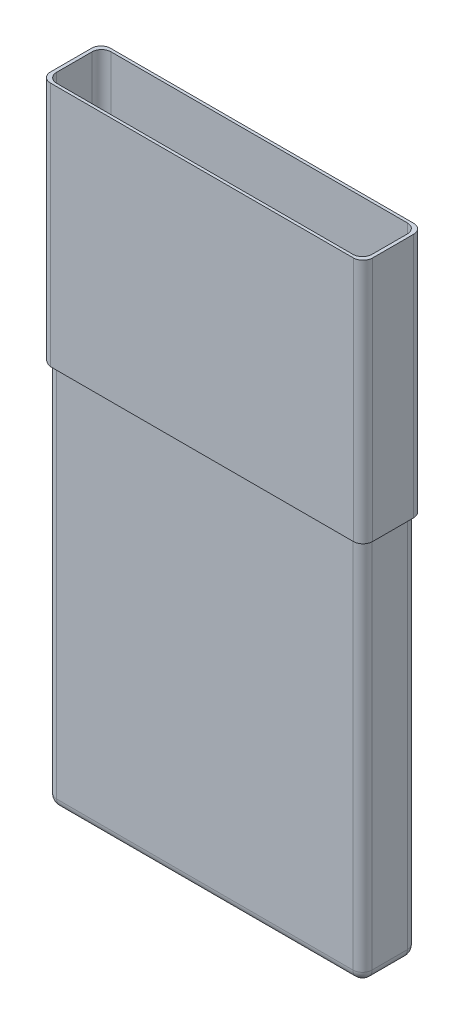
ISO-10303-21;
HEADER;
FILE_DESCRIPTION(('STEP AP214'),'2;1');
FILE_NAME('part.step','',(''),(''),'','','');
FILE_SCHEMA(('AUTOMOTIVE_DESIGN { 1 0 10303 214 1 1 1 1 }'));
ENDSEC;
DATA;
#1=APPLICATION_CONTEXT('core data for automotive mechanical design processes');
#2=APPLICATION_PROTOCOL_DEFINITION('international standard','automotive_design',2000,#1);
#3=PRODUCT_CONTEXT('',#1,'mechanical');
#4=PRODUCT('Part','Part','',(#3));
#5=PRODUCT_RELATED_PRODUCT_CATEGORY('part','',(#4));
#6=PRODUCT_DEFINITION_FORMATION('','',#4);
#7=PRODUCT_DEFINITION_CONTEXT('part definition',#1,'design');
#8=PRODUCT_DEFINITION('design','',#6,#7);
#9=PRODUCT_DEFINITION_SHAPE('','',#8);
#10=(LENGTH_UNIT() NAMED_UNIT(*) SI_UNIT(.MILLI.,.METRE.));
#11=(NAMED_UNIT(*) PLANE_ANGLE_UNIT() SI_UNIT($,.RADIAN.));
#12=(NAMED_UNIT(*) SI_UNIT($,.STERADIAN.) SOLID_ANGLE_UNIT());
#13=UNCERTAINTY_MEASURE_WITH_UNIT(LENGTH_MEASURE(1.E-05),#10,'distance_accuracy_value','');
#14=(GEOMETRIC_REPRESENTATION_CONTEXT(3) GLOBAL_UNCERTAINTY_ASSIGNED_CONTEXT((#13)) GLOBAL_UNIT_ASSIGNED_CONTEXT((#10,
#11,#12)) REPRESENTATION_CONTEXT('',''));
#15=CARTESIAN_POINT('',(0.,0.,0.));
#16=DIRECTION('',(0.,0.,1.));
#17=DIRECTION('',(1.,0.,0.));
#18=AXIS2_PLACEMENT_3D('',#15,#16,#17);
#19=CARTESIAN_POINT('',(0.,0.,5.7));
#20=DIRECTION('',(1.,0.,0.));
#21=DIRECTION('',(0.,1.,0.));
#22=AXIS2_PLACEMENT_3D('',#19,#20,#21);
#23=PLANE('',#22);
#24=DIRECTION('',(0.,-1.,0.));
#25=VECTOR('',#24,1.);
#26=CARTESIAN_POINT('',(0.,-12.85,4.7));
#27=LINE('',#26,#25);
#28=CARTESIAN_POINT('',(0.,-52.,4.7));
#29=VERTEX_POINT('',#28);
#30=CARTESIAN_POINT('',(0.,-12.6112983092984,4.7));
#31=VERTEX_POINT('',#30);
#32=EDGE_CURVE('E59',#29,#31,#27,.F.);
#33=ORIENTED_EDGE('',*,*,#32,.T.);
#34=DIRECTION('',(0.,0.,1.));
#35=VECTOR('',#34,1.);
#36=CARTESIAN_POINT('',(0.,-12.6112983092984,4.7));
#37=LINE('',#36,#35);
#38=CARTESIAN_POINT('',(0.,-12.6112983092984,1.));
#39=VERTEX_POINT('',#38);
#40=EDGE_CURVE('E45',#31,#39,#37,.F.);
#41=ORIENTED_EDGE('',*,*,#40,.T.);
#42=DIRECTION('',(0.,-1.,0.));
#43=VECTOR('',#42,1.);
#44=CARTESIAN_POINT('',(0.,0.,1.));
#45=LINE('',#44,#43);
#46=CARTESIAN_POINT('',(0.,-52.,1.));
#47=VERTEX_POINT('',#46);
#48=EDGE_CURVE('E52',#39,#47,#45,.T.);
#49=ORIENTED_EDGE('',*,*,#48,.T.);
#50=DIRECTION('',(0.,0.,-1.));
#51=VECTOR('',#50,1.);
#52=CARTESIAN_POINT('',(0.,-52.,5.7));
#53=LINE('',#52,#51);
#54=EDGE_CURVE('E502',#47,#29,#53,.F.);
#55=ORIENTED_EDGE('',*,*,#54,.T.);
#56=EDGE_LOOP('',(#33,#41,#49,#55));
#57=FACE_BOUND('',#56,.T.);
#58=ADVANCED_FACE('F36',(#57),#23,.F.);
#59=CARTESIAN_POINT('',(33.,0.,5.7));
#60=DIRECTION('',(-1.,0.,0.));
#61=DIRECTION('',(0.,-1.,0.));
#62=AXIS2_PLACEMENT_3D('',#59,#60,#61);
#63=PLANE('',#62);
#64=DIRECTION('',(0.,0.,-1.));
#65=VECTOR('',#64,1.);
#66=CARTESIAN_POINT('',(33.,-52.,5.7));
#67=LINE('',#66,#65);
#68=CARTESIAN_POINT('',(33.,-52.,4.7));
#69=VERTEX_POINT('',#68);
#70=CARTESIAN_POINT('',(33.,-52.,1.));
#71=VERTEX_POINT('',#70);
#72=EDGE_CURVE('E494',#69,#71,#67,.T.);
#73=ORIENTED_EDGE('',*,*,#72,.T.);
#74=DIRECTION('',(0.,1.,0.));
#75=VECTOR('',#74,1.);
#76=CARTESIAN_POINT('',(33.,0.,1.));
#77=LINE('',#76,#75);
#78=CARTESIAN_POINT('',(33.,-12.85,1.));
#79=VERTEX_POINT('',#78);
#80=EDGE_CURVE('E251',#71,#79,#77,.T.);
#81=ORIENTED_EDGE('',*,*,#80,.T.);
#82=DIRECTION('',(0.,0.,-1.));
#83=VECTOR('',#82,1.);
#84=CARTESIAN_POINT('',(33.,-12.85,0.));
#85=LINE('',#84,#83);
#86=CARTESIAN_POINT('',(33.,-12.85,4.7));
#87=VERTEX_POINT('',#86);
#88=EDGE_CURVE('E532',#87,#79,#85,.T.);
#89=ORIENTED_EDGE('',*,*,#88,.F.);
#90=DIRECTION('',(0.,1.,0.));
#91=VECTOR('',#90,1.);
#92=CARTESIAN_POINT('',(33.,-52.,4.7));
#93=LINE('',#92,#91);
#94=EDGE_CURVE('E492',#87,#69,#93,.F.);
#95=ORIENTED_EDGE('',*,*,#94,.T.);
#96=EDGE_LOOP('',(#73,#81,#89,#95));
#97=FACE_BOUND('',#96,.T.);
#98=ADVANCED_FACE('F407',(#97),#63,.F.);
#99=CARTESIAN_POINT('',(0.,0.,5.7));
#100=DIRECTION('',(0.,0.,1.));
#101=DIRECTION('',(1.,0.,0.));
#102=AXIS2_PLACEMENT_3D('',#99,#100,#101);
#103=PLANE('',#102);
#104=DIRECTION('',(1.,0.,0.));
#105=VECTOR('',#104,1.);
#106=CARTESIAN_POINT('',(0.,-12.85,5.7));
#107=LINE('',#106,#105);
#108=CARTESIAN_POINT('',(1.,-12.85,5.7));
#109=VERTEX_POINT('',#108);
#110=CARTESIAN_POINT('',(32.,-12.85,5.7));
#111=VERTEX_POINT('',#110);
#112=EDGE_CURVE('E527',#109,#111,#107,.T.);
#113=ORIENTED_EDGE('',*,*,#112,.F.);
#114=DIRECTION('',(0.,-1.,0.));
#115=VECTOR('',#114,1.);
#116=CARTESIAN_POINT('',(1.00000000000001,-52.,5.7));
#117=LINE('',#116,#115);
#118=CARTESIAN_POINT('',(1.00000000000001,-52.,5.7));
#119=VERTEX_POINT('',#118);
#120=EDGE_CURVE('E508',#109,#119,#117,.T.);
#121=ORIENTED_EDGE('',*,*,#120,.T.);
#122=DIRECTION('',(1.,0.,0.));
#123=VECTOR('',#122,1.);
#124=CARTESIAN_POINT('',(33.,-52.,5.7));
#125=LINE('',#124,#123);
#126=CARTESIAN_POINT('',(32.,-52.,5.7));
#127=VERTEX_POINT('',#126);
#128=EDGE_CURVE('E238',#119,#127,#125,.T.);
#129=ORIENTED_EDGE('',*,*,#128,.T.);
#130=DIRECTION('',(0.,1.,0.));
#131=VECTOR('',#130,1.);
#132=CARTESIAN_POINT('',(32.,-12.85,5.7));
#133=LINE('',#132,#131);
#134=EDGE_CURVE('E506',#127,#111,#133,.T.);
#135=ORIENTED_EDGE('',*,*,#134,.T.);
#136=EDGE_LOOP('',(#113,#121,#129,#135));
#137=FACE_BOUND('',#136,.T.);
#138=ADVANCED_FACE('F412',(#137),#103,.T.);
#139=CARTESIAN_POINT('',(0.,0.,0.));
#140=DIRECTION('',(0.,0.,1.));
#141=DIRECTION('',(1.,0.,0.));
#142=AXIS2_PLACEMENT_3D('',#139,#140,#141);
#143=PLANE('',#142);
#144=DIRECTION('',(1.,0.,0.));
#145=VECTOR('',#144,1.);
#146=CARTESIAN_POINT('',(0.,-52.,0.));
#147=LINE('',#146,#145);
#148=CARTESIAN_POINT('',(32.,-52.,0.));
#149=VERTEX_POINT('',#148);
#150=CARTESIAN_POINT('',(1.00000000000001,-52.,0.));
#151=VERTEX_POINT('',#150);
#152=EDGE_CURVE('E220',#149,#151,#147,.F.);
#153=ORIENTED_EDGE('',*,*,#152,.T.);
#154=DIRECTION('',(0.,-1.,0.));
#155=VECTOR('',#154,1.);
#156=CARTESIAN_POINT('',(1.,0.,0.));
#157=LINE('',#156,#155);
#158=CARTESIAN_POINT('',(1.,-12.85,0.));
#159=VERTEX_POINT('',#158);
#160=EDGE_CURVE('E226',#151,#159,#157,.F.);
#161=ORIENTED_EDGE('',*,*,#160,.T.);
#162=DIRECTION('',(-1.,0.,0.));
#163=VECTOR('',#162,1.);
#164=CARTESIAN_POINT('',(0.,-12.85,0.));
#165=LINE('',#164,#163);
#166=CARTESIAN_POINT('',(32.,-12.85,0.));
#167=VERTEX_POINT('',#166);
#168=EDGE_CURVE('E222',#167,#159,#165,.T.);
#169=ORIENTED_EDGE('',*,*,#168,.F.);
#170=DIRECTION('',(0.,1.,0.));
#171=VECTOR('',#170,1.);
#172=CARTESIAN_POINT('',(32.,0.,0.));
#173=LINE('',#172,#171);
#174=EDGE_CURVE('E217',#167,#149,#173,.F.);
#175=ORIENTED_EDGE('',*,*,#174,.T.);
#176=EDGE_LOOP('',(#153,#161,#169,#175));
#177=FACE_BOUND('',#176,.T.);
#178=ADVANCED_FACE('F219',(#177),#143,.F.);
#179=CARTESIAN_POINT('',(0.,-53.,5.7));
#180=DIRECTION('',(0.,1.,0.));
#181=DIRECTION('',(0.,0.,1.));
#182=AXIS2_PLACEMENT_3D('',#179,#180,#181);
#183=PLANE('',#182);
#184=DIRECTION('',(1.,0.,0.));
#185=VECTOR('',#184,1.);
#186=CARTESIAN_POINT('',(0.,-53.,1.));
#187=LINE('',#186,#185);
#188=CARTESIAN_POINT('',(1.00000000000001,-53.,1.));
#189=VERTEX_POINT('',#188);
#190=CARTESIAN_POINT('',(32.,-53.,1.));
#191=VERTEX_POINT('',#190);
#192=EDGE_CURVE('E239',#189,#191,#187,.T.);
#193=ORIENTED_EDGE('',*,*,#192,.T.);
#194=DIRECTION('',(0.,0.,-1.));
#195=VECTOR('',#194,1.);
#196=CARTESIAN_POINT('',(32.,-53.,5.7));
#197=LINE('',#196,#195);
#198=CARTESIAN_POINT('',(32.,-53.,4.7));
#199=VERTEX_POINT('',#198);
#200=EDGE_CURVE('E499',#191,#199,#197,.F.);
#201=ORIENTED_EDGE('',*,*,#200,.T.);
#202=DIRECTION('',(1.,0.,0.));
#203=VECTOR('',#202,1.);
#204=CARTESIAN_POINT('',(0.,-53.,4.7));
#205=LINE('',#204,#203);
#206=CARTESIAN_POINT('',(1.00000000000001,-53.,4.7));
#207=VERTEX_POINT('',#206);
#208=EDGE_CURVE('E481',#199,#207,#205,.F.);
#209=ORIENTED_EDGE('',*,*,#208,.T.);
#210=DIRECTION('',(0.,0.,-1.));
#211=VECTOR('',#210,1.);
#212=CARTESIAN_POINT('',(1.00000000000001,-53.,5.7));
#213=LINE('',#212,#211);
#214=EDGE_CURVE('E497',#207,#189,#213,.T.);
#215=ORIENTED_EDGE('',*,*,#214,.T.);
#216=EDGE_LOOP('',(#193,#201,#209,#215));
#217=FACE_BOUND('',#216,.T.);
#218=ADVANCED_FACE('F417',(#217),#183,.F.);
#219=CARTESIAN_POINT('',(0.,-52.,1.));
#220=DIRECTION('',(1.,0.,0.));
#221=DIRECTION('',(0.,0.,-1.));
#222=AXIS2_PLACEMENT_3D('',#219,#220,#221);
#223=CYLINDRICAL_SURFACE('',#222,1.);
#224=ORIENTED_EDGE('',*,*,#192,.F.);
#225=CARTESIAN_POINT('',(1.00000000000001,-52.,1.));
#226=DIRECTION('',(1.,0.,0.));
#227=DIRECTION('',(0.,0.,-1.));
#228=AXIS2_PLACEMENT_3D('',#225,#226,#227);
#229=CIRCLE('',#228,1.);
#230=EDGE_CURVE('E237',#189,#151,#229,.T.);
#231=ORIENTED_EDGE('',*,*,#230,.T.);
#232=ORIENTED_EDGE('',*,*,#152,.F.);
#233=CARTESIAN_POINT('',(32.,-52.,1.));
#234=DIRECTION('',(1.,0.,0.));
#235=DIRECTION('',(0.,0.,-1.));
#236=AXIS2_PLACEMENT_3D('',#233,#234,#235);
#237=CIRCLE('',#236,1.);
#238=EDGE_CURVE('E234',#149,#191,#237,.F.);
#239=ORIENTED_EDGE('',*,*,#238,.T.);
#240=EDGE_LOOP('',(#224,#231,#232,#239));
#241=FACE_BOUND('',#240,.T.);
#242=ADVANCED_FACE('F233',(#241),#223,.T.);
#243=CARTESIAN_POINT('',(0.,-52.,4.7));
#244=DIRECTION('',(-1.,0.,0.));
#245=DIRECTION('',(0.,0.,1.));
#246=AXIS2_PLACEMENT_3D('',#243,#244,#245);
#247=CYLINDRICAL_SURFACE('',#246,1.);
#248=ORIENTED_EDGE('',*,*,#128,.F.);
#249=CARTESIAN_POINT('',(1.00000000000001,-52.,4.7));
#250=DIRECTION('',(-1.,0.,0.));
#251=DIRECTION('',(0.,0.,1.));
#252=AXIS2_PLACEMENT_3D('',#249,#250,#251);
#253=CIRCLE('',#252,1.);
#254=EDGE_CURVE('E490',#119,#207,#253,.F.);
#255=ORIENTED_EDGE('',*,*,#254,.T.);
#256=ORIENTED_EDGE('',*,*,#208,.F.);
#257=CARTESIAN_POINT('',(32.,-52.,4.7));
#258=DIRECTION('',(-1.,0.,0.));
#259=DIRECTION('',(0.,0.,1.));
#260=AXIS2_PLACEMENT_3D('',#257,#258,#259);
#261=CIRCLE('',#260,1.);
#262=EDGE_CURVE('E488',#199,#127,#261,.T.);
#263=ORIENTED_EDGE('',*,*,#262,.T.);
#264=EDGE_LOOP('',(#248,#255,#256,#263));
#265=FACE_BOUND('',#264,.T.);
#266=ADVANCED_FACE('F420',(#265),#247,.T.);
#267=CARTESIAN_POINT('',(0.,12.85,5.7));
#268=DIRECTION('',(0.,0.,-1.));
#269=DIRECTION('',(-1.,0.,0.));
#270=AXIS2_PLACEMENT_3D('',#267,#268,#269);
#271=PLANE('',#270);
#272=DIRECTION('',(-1.,0.,0.));
#273=VECTOR('',#272,1.);
#274=CARTESIAN_POINT('',(0.,0.,5.7));
#275=LINE('',#274,#273);
#276=CARTESIAN_POINT('',(32.,0.,5.7));
#277=VERTEX_POINT('',#276);
#278=CARTESIAN_POINT('',(1.,0.,5.7));
#279=VERTEX_POINT('',#278);
#280=EDGE_CURVE('E469',#277,#279,#275,.T.);
#281=ORIENTED_EDGE('',*,*,#280,.T.);
#282=DIRECTION('',(0.,-1.,0.));
#283=VECTOR('',#282,1.);
#284=CARTESIAN_POINT('',(1.,12.85,5.7));
#285=LINE('',#284,#283);
#286=CARTESIAN_POINT('',(1.,12.85,5.7));
#287=VERTEX_POINT('',#286);
#288=EDGE_CURVE('E284',#279,#287,#285,.F.);
#289=ORIENTED_EDGE('',*,*,#288,.T.);
#290=DIRECTION('',(1.,0.,0.));
#291=VECTOR('',#290,1.);
#292=CARTESIAN_POINT('',(0.,12.85,5.7));
#293=LINE('',#292,#291);
#294=CARTESIAN_POINT('',(32.,12.85,5.7));
#295=VERTEX_POINT('',#294);
#296=EDGE_CURVE('E558',#287,#295,#293,.T.);
#297=ORIENTED_EDGE('',*,*,#296,.T.);
#298=DIRECTION('',(0.,-1.,0.));
#299=VECTOR('',#298,1.);
#300=CARTESIAN_POINT('',(32.,0.,5.7));
#301=LINE('',#300,#299);
#302=EDGE_CURVE('E281',#295,#277,#301,.T.);
#303=ORIENTED_EDGE('',*,*,#302,.T.);
#304=EDGE_LOOP('',(#281,#289,#297,#303));
#305=FACE_BOUND('',#304,.T.);
#306=ADVANCED_FACE('F423',(#305),#271,.T.);
#307=CARTESIAN_POINT('',(0.,12.85,0.));
#308=DIRECTION('',(0.,0.,1.));
#309=DIRECTION('',(1.,0.,0.));
#310=AXIS2_PLACEMENT_3D('',#307,#308,#309);
#311=PLANE('',#310);
#312=DIRECTION('',(-1.,0.,0.));
#313=VECTOR('',#312,1.);
#314=CARTESIAN_POINT('',(0.,12.85,0.));
#315=LINE('',#314,#313);
#316=CARTESIAN_POINT('',(32.,12.85,0.));
#317=VERTEX_POINT('',#316);
#318=CARTESIAN_POINT('',(1.,12.85,0.));
#319=VERTEX_POINT('',#318);
#320=EDGE_CURVE('E539',#317,#319,#315,.T.);
#321=ORIENTED_EDGE('',*,*,#320,.T.);
#322=DIRECTION('',(0.,-1.,0.));
#323=VECTOR('',#322,1.);
#324=CARTESIAN_POINT('',(1.,0.,0.));
#325=LINE('',#324,#323);
#326=CARTESIAN_POINT('',(1.,0.,0.));
#327=VERTEX_POINT('',#326);
#328=EDGE_CURVE('E288',#319,#327,#325,.T.);
#329=ORIENTED_EDGE('',*,*,#328,.T.);
#330=DIRECTION('',(-1.,0.,0.));
#331=VECTOR('',#330,1.);
#332=CARTESIAN_POINT('',(0.,0.,0.));
#333=LINE('',#332,#331);
#334=CARTESIAN_POINT('',(32.,0.,0.));
#335=VERTEX_POINT('',#334);
#336=EDGE_CURVE('E473',#335,#327,#333,.T.);
#337=ORIENTED_EDGE('',*,*,#336,.F.);
#338=DIRECTION('',(0.,-1.,0.));
#339=VECTOR('',#338,1.);
#340=CARTESIAN_POINT('',(32.,12.85,0.));
#341=LINE('',#340,#339);
#342=EDGE_CURVE('E286',#335,#317,#341,.F.);
#343=ORIENTED_EDGE('',*,*,#342,.T.);
#344=EDGE_LOOP('',(#321,#329,#337,#343));
#345=FACE_BOUND('',#344,.T.);
#346=ADVANCED_FACE('F588',(#345),#311,.T.);
#347=CARTESIAN_POINT('',(0.,12.85,0.));
#348=DIRECTION('',(1.,0.,0.));
#349=DIRECTION('',(0.,0.,-1.));
#350=AXIS2_PLACEMENT_3D('',#347,#348,#349);
#351=PLANE('',#350);
#352=DIRECTION('',(0.,0.,1.));
#353=VECTOR('',#352,1.);
#354=CARTESIAN_POINT('',(0.,12.85,0.));
#355=LINE('',#354,#353);
#356=CARTESIAN_POINT('',(0.,12.85,1.));
#357=VERTEX_POINT('',#356);
#358=CARTESIAN_POINT('',(0.,12.85,4.7));
#359=VERTEX_POINT('',#358);
#360=EDGE_CURVE('E542',#357,#359,#355,.T.);
#361=ORIENTED_EDGE('',*,*,#360,.T.);
#362=DIRECTION('',(0.,-1.,0.));
#363=VECTOR('',#362,1.);
#364=CARTESIAN_POINT('',(0.,0.,4.7));
#365=LINE('',#364,#363);
#366=CARTESIAN_POINT('',(0.,0.,4.7));
#367=VERTEX_POINT('',#366);
#368=EDGE_CURVE('E269',#359,#367,#365,.T.);
#369=ORIENTED_EDGE('',*,*,#368,.T.);
#370=DIRECTION('',(0.,0.,-1.));
#371=VECTOR('',#370,1.);
#372=CARTESIAN_POINT('',(0.,0.,5.7));
#373=LINE('',#372,#371);
#374=CARTESIAN_POINT('',(0.,0.,1.));
#375=VERTEX_POINT('',#374);
#376=EDGE_CURVE('E472',#367,#375,#373,.T.);
#377=ORIENTED_EDGE('',*,*,#376,.T.);
#378=DIRECTION('',(0.,-1.,0.));
#379=VECTOR('',#378,1.);
#380=CARTESIAN_POINT('',(0.,12.85,1.));
#381=LINE('',#380,#379);
#382=EDGE_CURVE('E267',#375,#357,#381,.F.);
#383=ORIENTED_EDGE('',*,*,#382,.T.);
#384=EDGE_LOOP('',(#361,#369,#377,#383));
#385=FACE_BOUND('',#384,.T.);
#386=ADVANCED_FACE('F569',(#385),#351,.T.);
#387=CARTESIAN_POINT('',(33.,12.85,0.));
#388=DIRECTION('',(-1.,0.,0.));
#389=DIRECTION('',(0.,0.,1.));
#390=AXIS2_PLACEMENT_3D('',#387,#388,#389);
#391=PLANE('',#390);
#392=DIRECTION('',(0.,0.,-1.));
#393=VECTOR('',#392,1.);
#394=CARTESIAN_POINT('',(33.,12.85,0.));
#395=LINE('',#394,#393);
#396=CARTESIAN_POINT('',(33.,12.85,4.7));
#397=VERTEX_POINT('',#396);
#398=CARTESIAN_POINT('',(33.,12.85,1.));
#399=VERTEX_POINT('',#398);
#400=EDGE_CURVE('E553',#397,#399,#395,.T.);
#401=ORIENTED_EDGE('',*,*,#400,.T.);
#402=DIRECTION('',(0.,-1.,0.));
#403=VECTOR('',#402,1.);
#404=CARTESIAN_POINT('',(33.,0.,1.));
#405=LINE('',#404,#403);
#406=CARTESIAN_POINT('',(33.,0.,0.999999999999999));
#407=VERTEX_POINT('',#406);
#408=EDGE_CURVE('E293',#399,#407,#405,.T.);
#409=ORIENTED_EDGE('',*,*,#408,.T.);
#410=DIRECTION('',(0.,0.,-1.));
#411=VECTOR('',#410,1.);
#412=CARTESIAN_POINT('',(33.,0.,5.7));
#413=LINE('',#412,#411);
#414=CARTESIAN_POINT('',(33.,0.,4.7));
#415=VERTEX_POINT('',#414);
#416=EDGE_CURVE('E478',#415,#407,#413,.T.);
#417=ORIENTED_EDGE('',*,*,#416,.F.);
#418=DIRECTION('',(0.,-1.,0.));
#419=VECTOR('',#418,1.);
#420=CARTESIAN_POINT('',(33.,12.85,4.7));
#421=LINE('',#420,#419);
#422=EDGE_CURVE('E291',#415,#397,#421,.F.);
#423=ORIENTED_EDGE('',*,*,#422,.T.);
#424=EDGE_LOOP('',(#401,#409,#417,#423));
#425=FACE_BOUND('',#424,.T.);
#426=ADVANCED_FACE('F584',(#425),#391,.T.);
#427=CARTESIAN_POINT('',(0.,12.85,0.));
#428=DIRECTION('',(0.,1.,0.));
#429=DIRECTION('',(0.,0.,1.));
#430=AXIS2_PLACEMENT_3D('',#427,#428,#429);
#431=PLANE('',#430);
#432=DIRECTION('',(0.,0.,1.));
#433=VECTOR('',#432,1.);
#434=CARTESIAN_POINT('',(-0.351598207692164,12.85,-0.295956828932214));
#435=LINE('',#434,#433);
#436=CARTESIAN_POINT('',(-0.351598207692164,12.85,0.704043171067786));
#437=VERTEX_POINT('',#436);
#438=CARTESIAN_POINT('',(-0.351598207692164,12.85,4.99595682893221));
#439=VERTEX_POINT('',#438);
#440=EDGE_CURVE('E546',#437,#439,#435,.T.);
#441=ORIENTED_EDGE('',*,*,#440,.T.);
#442=CARTESIAN_POINT('',(0.648401792307836,12.85,4.99595682893221));
#443=DIRECTION('',(0.,1.,0.));
#444=DIRECTION('',(0.,0.,1.));
#445=AXIS2_PLACEMENT_3D('',#442,#443,#444);
#446=CIRCLE('',#445,1.);
#447=CARTESIAN_POINT('',(0.648401792307836,12.85,5.99595682893221));
#448=VERTEX_POINT('',#447);
#449=EDGE_CURVE('E313',#439,#448,#446,.T.);
#450=ORIENTED_EDGE('',*,*,#449,.T.);
#451=DIRECTION('',(1.,0.,0.));
#452=VECTOR('',#451,1.);
#453=CARTESIAN_POINT('',(-0.351598207692164,12.85,5.99595682893221));
#454=LINE('',#453,#452);
#455=CARTESIAN_POINT('',(32.3515982076922,12.85,5.99595682893221));
#456=VERTEX_POINT('',#455);
#457=EDGE_CURVE('E455',#448,#456,#454,.T.);
#458=ORIENTED_EDGE('',*,*,#457,.T.);
#459=CARTESIAN_POINT('',(32.3515982076922,12.85,4.99595682893221));
#460=DIRECTION('',(0.,1.,0.));
#461=DIRECTION('',(0.,0.,1.));
#462=AXIS2_PLACEMENT_3D('',#459,#460,#461);
#463=CIRCLE('',#462,1.);
#464=CARTESIAN_POINT('',(33.3515982076922,12.85,4.99595682893221));
#465=VERTEX_POINT('',#464);
#466=EDGE_CURVE('E309',#456,#465,#463,.T.);
#467=ORIENTED_EDGE('',*,*,#466,.T.);
#468=DIRECTION('',(0.,0.,-1.));
#469=VECTOR('',#468,1.);
#470=CARTESIAN_POINT('',(33.3515982076922,12.85,-0.295956828932214));
#471=LINE('',#470,#469);
#472=CARTESIAN_POINT('',(33.3515982076922,12.85,0.704043171067786));
#473=VERTEX_POINT('',#472);
#474=EDGE_CURVE('E458',#465,#473,#471,.T.);
#475=ORIENTED_EDGE('',*,*,#474,.T.);
#476=CARTESIAN_POINT('',(32.3515982076922,12.85,0.704043171067786));
#477=DIRECTION('',(0.,1.,0.));
#478=DIRECTION('',(0.,0.,1.));
#479=AXIS2_PLACEMENT_3D('',#476,#477,#478);
#480=CIRCLE('',#479,1.);
#481=CARTESIAN_POINT('',(32.3515982076922,12.85,-0.295956828932214));
#482=VERTEX_POINT('',#481);
#483=EDGE_CURVE('E307',#473,#482,#480,.T.);
#484=ORIENTED_EDGE('',*,*,#483,.T.);
#485=DIRECTION('',(-1.,0.,0.));
#486=VECTOR('',#485,1.);
#487=CARTESIAN_POINT('',(-0.351598207692164,12.85,-0.295956828932214));
#488=LINE('',#487,#486);
#489=CARTESIAN_POINT('',(0.648401792307836,12.85,-0.295956828932214));
#490=VERTEX_POINT('',#489);
#491=EDGE_CURVE('E462',#482,#490,#488,.T.);
#492=ORIENTED_EDGE('',*,*,#491,.T.);
#493=CARTESIAN_POINT('',(0.648401792307836,12.85,0.704043171067786));
#494=DIRECTION('',(0.,1.,0.));
#495=DIRECTION('',(0.,0.,1.));
#496=AXIS2_PLACEMENT_3D('',#493,#494,#495);
#497=CIRCLE('',#496,1.);
#498=EDGE_CURVE('E311',#490,#437,#497,.T.);
#499=ORIENTED_EDGE('',*,*,#498,.T.);
#500=EDGE_LOOP('',(#441,#450,#458,#467,#475,#484,#492,#499));
#501=FACE_BOUND('',#500,.T.);
#502=ORIENTED_EDGE('',*,*,#296,.F.);
#503=CARTESIAN_POINT('',(1.,12.85,4.7));
#504=DIRECTION('',(0.,1.,0.));
#505=DIRECTION('',(0.,0.,1.));
#506=AXIS2_PLACEMENT_3D('',#503,#504,#505);
#507=CIRCLE('',#506,1.);
#508=EDGE_CURVE('E333',#287,#359,#507,.F.);
#509=ORIENTED_EDGE('',*,*,#508,.T.);
#510=ORIENTED_EDGE('',*,*,#360,.F.);
#511=CARTESIAN_POINT('',(1.,12.85,1.));
#512=DIRECTION('',(0.,1.,0.));
#513=DIRECTION('',(0.,0.,1.));
#514=AXIS2_PLACEMENT_3D('',#511,#512,#513);
#515=CIRCLE('',#514,1.);
#516=EDGE_CURVE('E335',#357,#319,#515,.F.);
#517=ORIENTED_EDGE('',*,*,#516,.T.);
#518=ORIENTED_EDGE('',*,*,#320,.F.);
#519=CARTESIAN_POINT('',(32.,12.85,1.));
#520=DIRECTION('',(0.,1.,0.));
#521=DIRECTION('',(0.,0.,1.));
#522=AXIS2_PLACEMENT_3D('',#519,#520,#521);
#523=CIRCLE('',#522,1.);
#524=EDGE_CURVE('E337',#317,#399,#523,.F.);
#525=ORIENTED_EDGE('',*,*,#524,.T.);
#526=ORIENTED_EDGE('',*,*,#400,.F.);
#527=CARTESIAN_POINT('',(32.,12.85,4.7));
#528=DIRECTION('',(0.,1.,0.));
#529=DIRECTION('',(0.,0.,1.));
#530=AXIS2_PLACEMENT_3D('',#527,#528,#529);
#531=CIRCLE('',#530,1.);
#532=EDGE_CURVE('E339',#397,#295,#531,.F.);
#533=ORIENTED_EDGE('',*,*,#532,.T.);
#534=EDGE_LOOP('',(#502,#509,#510,#517,#518,#525,#526,#533));
#535=FACE_BOUND('',#534,.T.);
#536=ADVANCED_FACE('F589',(#501,#535),#431,.T.);
#537=CARTESIAN_POINT('',(0.,-12.85,0.));
#538=DIRECTION('',(0.,1.,0.));
#539=DIRECTION('',(0.,0.,1.));
#540=AXIS2_PLACEMENT_3D('',#537,#538,#539);
#541=PLANE('',#540);
#542=DIRECTION('',(1.,0.,0.));
#543=VECTOR('',#542,1.);
#544=CARTESIAN_POINT('',(-0.351598207692164,-12.85,5.99595682893221));
#545=LINE('',#544,#543);
#546=CARTESIAN_POINT('',(0.648401792307837,-12.85,5.99595682893221));
#547=VERTEX_POINT('',#546);
#548=CARTESIAN_POINT('',(32.3515982076922,-12.85,5.99595682893221));
#549=VERTEX_POINT('',#548);
#550=EDGE_CURVE('E452',#547,#549,#545,.T.);
#551=ORIENTED_EDGE('',*,*,#550,.F.);
#552=DIRECTION('',(0.,0.,1.));
#553=VECTOR('',#552,1.);
#554=CARTESIAN_POINT('',(0.648401792307836,-12.85,0.));
#555=LINE('',#554,#553);
#556=CARTESIAN_POINT('',(0.648401792307836,-12.85,5.63615100296248));
#557=VERTEX_POINT('',#556);
#558=EDGE_CURVE('E321',#547,#557,#555,.F.);
#559=ORIENTED_EDGE('',*,*,#558,.T.);
#560=CARTESIAN_POINT('',(1.,-12.85,4.7));
#561=DIRECTION('',(0.,1.,0.));
#562=DIRECTION('',(0.,0.,1.));
#563=AXIS2_PLACEMENT_3D('',#560,#561,#562);
#564=CIRCLE('',#563,1.);
#565=EDGE_CURVE('E515',#557,#109,#564,.T.);
#566=ORIENTED_EDGE('',*,*,#565,.T.);
#567=ORIENTED_EDGE('',*,*,#112,.T.);
#568=CARTESIAN_POINT('',(32.,-12.85,4.7));
#569=DIRECTION('',(0.,1.,0.));
#570=DIRECTION('',(0.,0.,1.));
#571=AXIS2_PLACEMENT_3D('',#568,#569,#570);
#572=CIRCLE('',#571,1.);
#573=EDGE_CURVE('E270',#111,#87,#572,.T.);
#574=ORIENTED_EDGE('',*,*,#573,.T.);
#575=ORIENTED_EDGE('',*,*,#88,.T.);
#576=CARTESIAN_POINT('',(32.,-12.85,1.));
#577=DIRECTION('',(0.,1.,0.));
#578=DIRECTION('',(0.,0.,1.));
#579=AXIS2_PLACEMENT_3D('',#576,#577,#578);
#580=CIRCLE('',#579,1.);
#581=EDGE_CURVE('E513',#79,#167,#580,.T.);
#582=ORIENTED_EDGE('',*,*,#581,.T.);
#583=ORIENTED_EDGE('',*,*,#168,.T.);
#584=CARTESIAN_POINT('',(1.,-12.85,1.));
#585=DIRECTION('',(0.,1.,0.));
#586=DIRECTION('',(0.,0.,1.));
#587=AXIS2_PLACEMENT_3D('',#584,#585,#586);
#588=CIRCLE('',#587,1.);
#589=CARTESIAN_POINT('',(0.648401792307836,-12.85,0.0638489970375202));
#590=VERTEX_POINT('',#589);
#591=EDGE_CURVE('E510',#159,#590,#588,.T.);
#592=ORIENTED_EDGE('',*,*,#591,.T.);
#593=DIRECTION('',(0.,0.,1.));
#594=VECTOR('',#593,1.);
#595=CARTESIAN_POINT('',(0.648401792307836,-12.85,0.));
#596=LINE('',#595,#594);
#597=CARTESIAN_POINT('',(0.648401792307837,-12.85,-0.295956828932214));
#598=VERTEX_POINT('',#597);
#599=EDGE_CURVE('E319',#590,#598,#596,.F.);
#600=ORIENTED_EDGE('',*,*,#599,.T.);
#601=DIRECTION('',(-1.,0.,0.));
#602=VECTOR('',#601,1.);
#603=CARTESIAN_POINT('',(-0.351598207692164,-12.85,-0.295956828932214));
#604=LINE('',#603,#602);
#605=CARTESIAN_POINT('',(32.3515982076922,-12.85,-0.295956828932214));
#606=VERTEX_POINT('',#605);
#607=EDGE_CURVE('E459',#606,#598,#604,.T.);
#608=ORIENTED_EDGE('',*,*,#607,.F.);
#609=CARTESIAN_POINT('',(32.3515982076922,-12.85,0.704043171067786));
#610=DIRECTION('',(0.,1.,0.));
#611=DIRECTION('',(0.,0.,1.));
#612=AXIS2_PLACEMENT_3D('',#609,#610,#611);
#613=CIRCLE('',#612,1.);
#614=CARTESIAN_POINT('',(33.3515982076922,-12.85,0.704043171067786));
#615=VERTEX_POINT('',#614);
#616=EDGE_CURVE('E315',#606,#615,#613,.F.);
#617=ORIENTED_EDGE('',*,*,#616,.T.);
#618=DIRECTION('',(0.,0.,-1.));
#619=VECTOR('',#618,1.);
#620=CARTESIAN_POINT('',(33.3515982076922,-12.85,-0.295956828932214));
#621=LINE('',#620,#619);
#622=CARTESIAN_POINT('',(33.3515982076922,-12.85,4.99595682893221));
#623=VERTEX_POINT('',#622);
#624=EDGE_CURVE('E465',#623,#615,#621,.T.);
#625=ORIENTED_EDGE('',*,*,#624,.F.);
#626=CARTESIAN_POINT('',(32.3515982076922,-12.85,4.99595682893221));
#627=DIRECTION('',(0.,1.,0.));
#628=DIRECTION('',(0.,0.,1.));
#629=AXIS2_PLACEMENT_3D('',#626,#627,#628);
#630=CIRCLE('',#629,1.);
#631=EDGE_CURVE('E317',#623,#549,#630,.F.);
#632=ORIENTED_EDGE('',*,*,#631,.T.);
#633=EDGE_LOOP('',(#551,#559,#566,#567,#574,#575,#582,#583,#592,#600,#608,#617,#625,#632));
#634=FACE_BOUND('',#633,.T.);
#635=ADVANCED_FACE('F456',(#634),#541,.F.);
#636=CARTESIAN_POINT('',(33.3515982076922,12.85,-0.295956828932214));
#637=DIRECTION('',(-1.,0.,0.));
#638=DIRECTION('',(0.,0.,1.));
#639=AXIS2_PLACEMENT_3D('',#636,#637,#638);
#640=PLANE('',#639);
#641=ORIENTED_EDGE('',*,*,#474,.F.);
#642=DIRECTION('',(0.,-1.,0.));
#643=VECTOR('',#642,1.);
#644=CARTESIAN_POINT('',(33.3515982076922,12.85,4.99595682893221));
#645=LINE('',#644,#643);
#646=EDGE_CURVE('E330',#465,#623,#645,.T.);
#647=ORIENTED_EDGE('',*,*,#646,.T.);
#648=ORIENTED_EDGE('',*,*,#624,.T.);
#649=DIRECTION('',(0.,-1.,0.));
#650=VECTOR('',#649,1.);
#651=CARTESIAN_POINT('',(33.3515982076922,12.85,0.704043171067786));
#652=LINE('',#651,#650);
#653=EDGE_CURVE('E328',#615,#473,#652,.F.);
#654=ORIENTED_EDGE('',*,*,#653,.T.);
#655=EDGE_LOOP('',(#641,#647,#648,#654));
#656=FACE_BOUND('',#655,.T.);
#657=ADVANCED_FACE('F597',(#656),#640,.F.);
#658=CARTESIAN_POINT('',(-0.351598207692164,12.85,-0.295956828932214));
#659=DIRECTION('',(0.,0.,1.));
#660=DIRECTION('',(1.,0.,0.));
#661=AXIS2_PLACEMENT_3D('',#658,#659,#660);
#662=PLANE('',#661);
#663=ORIENTED_EDGE('',*,*,#607,.T.);
#664=DIRECTION('',(0.,-1.,0.));
#665=VECTOR('',#664,1.);
#666=CARTESIAN_POINT('',(0.648401792307836,12.85,-0.295956828932214));
#667=LINE('',#666,#665);
#668=EDGE_CURVE('E326',#598,#490,#667,.F.);
#669=ORIENTED_EDGE('',*,*,#668,.T.);
#670=ORIENTED_EDGE('',*,*,#491,.F.);
#671=DIRECTION('',(0.,-1.,0.));
#672=VECTOR('',#671,1.);
#673=CARTESIAN_POINT('',(32.3515982076922,12.85,-0.295956828932214));
#674=LINE('',#673,#672);
#675=EDGE_CURVE('E323',#482,#606,#674,.T.);
#676=ORIENTED_EDGE('',*,*,#675,.T.);
#677=EDGE_LOOP('',(#663,#669,#670,#676));
#678=FACE_BOUND('',#677,.T.);
#679=ADVANCED_FACE('F608',(#678),#662,.F.);
#680=CARTESIAN_POINT('',(-0.351598207692164,12.85,-0.295956828932214));
#681=DIRECTION('',(1.,0.,0.));
#682=DIRECTION('',(0.,0.,-1.));
#683=AXIS2_PLACEMENT_3D('',#680,#681,#682);
#684=PLANE('',#683);
#685=DIRECTION('',(0.,0.,1.));
#686=VECTOR('',#685,1.);
#687=CARTESIAN_POINT('',(-0.351598207692164,-11.85,-0.295956828932214));
#688=LINE('',#687,#686);
#689=CARTESIAN_POINT('',(-0.351598207692164,-11.85,0.704043171067786));
#690=VERTEX_POINT('',#689);
#691=CARTESIAN_POINT('',(-0.351598207692164,-11.85,4.99595682893221));
#692=VERTEX_POINT('',#691);
#693=EDGE_CURVE('E303',#690,#692,#688,.T.);
#694=ORIENTED_EDGE('',*,*,#693,.T.);
#695=DIRECTION('',(0.,-1.,0.));
#696=VECTOR('',#695,1.);
#697=CARTESIAN_POINT('',(-0.351598207692164,12.85,4.99595682893221));
#698=LINE('',#697,#696);
#699=EDGE_CURVE('E305',#692,#439,#698,.F.);
#700=ORIENTED_EDGE('',*,*,#699,.T.);
#701=ORIENTED_EDGE('',*,*,#440,.F.);
#702=DIRECTION('',(0.,-1.,0.));
#703=VECTOR('',#702,1.);
#704=CARTESIAN_POINT('',(-0.351598207692164,12.85,0.704043171067786));
#705=LINE('',#704,#703);
#706=EDGE_CURVE('E301',#437,#690,#705,.T.);
#707=ORIENTED_EDGE('',*,*,#706,.T.);
#708=EDGE_LOOP('',(#694,#700,#701,#707));
#709=FACE_BOUND('',#708,.T.);
#710=ADVANCED_FACE('F605',(#709),#684,.F.);
#711=CARTESIAN_POINT('',(-0.351598207692164,12.85,5.99595682893221));
#712=DIRECTION('',(0.,0.,-1.));
#713=DIRECTION('',(-1.,0.,0.));
#714=AXIS2_PLACEMENT_3D('',#711,#712,#713);
#715=PLANE('',#714);
#716=ORIENTED_EDGE('',*,*,#457,.F.);
#717=DIRECTION('',(0.,-1.,0.));
#718=VECTOR('',#717,1.);
#719=CARTESIAN_POINT('',(0.648401792307836,12.85,5.99595682893221));
#720=LINE('',#719,#718);
#721=EDGE_CURVE('E298',#448,#547,#720,.T.);
#722=ORIENTED_EDGE('',*,*,#721,.T.);
#723=ORIENTED_EDGE('',*,*,#550,.T.);
#724=DIRECTION('',(0.,-1.,0.));
#725=VECTOR('',#724,1.);
#726=CARTESIAN_POINT('',(32.3515982076922,12.85,5.99595682893221));
#727=LINE('',#726,#725);
#728=EDGE_CURVE('E296',#549,#456,#727,.F.);
#729=ORIENTED_EDGE('',*,*,#728,.T.);
#730=EDGE_LOOP('',(#716,#722,#723,#729));
#731=FACE_BOUND('',#730,.T.);
#732=ADVANCED_FACE('F451',(#731),#715,.F.);
#733=CARTESIAN_POINT('',(0.,0.,5.7));
#734=DIRECTION('',(0.,-1.,0.));
#735=DIRECTION('',(0.,0.,-1.));
#736=AXIS2_PLACEMENT_3D('',#733,#734,#735);
#737=PLANE('',#736);
#738=ORIENTED_EDGE('',*,*,#376,.F.);
#739=CARTESIAN_POINT('',(1.,0.,4.7));
#740=DIRECTION('',(0.,-1.,0.));
#741=DIRECTION('',(0.,0.,-1.));
#742=AXIS2_PLACEMENT_3D('',#739,#740,#741);
#743=CIRCLE('',#742,1.);
#744=EDGE_CURVE('E279',#367,#279,#743,.F.);
#745=ORIENTED_EDGE('',*,*,#744,.T.);
#746=ORIENTED_EDGE('',*,*,#280,.F.);
#747=CARTESIAN_POINT('',(32.,0.,4.7));
#748=DIRECTION('',(0.,-1.,0.));
#749=DIRECTION('',(0.,0.,-1.));
#750=AXIS2_PLACEMENT_3D('',#747,#748,#749);
#751=CIRCLE('',#750,1.);
#752=EDGE_CURVE('E273',#277,#415,#751,.F.);
#753=ORIENTED_EDGE('',*,*,#752,.T.);
#754=ORIENTED_EDGE('',*,*,#416,.T.);
#755=CARTESIAN_POINT('',(32.,0.,1.));
#756=DIRECTION('',(0.,-1.,0.));
#757=DIRECTION('',(0.,0.,-1.));
#758=AXIS2_PLACEMENT_3D('',#755,#756,#757);
#759=CIRCLE('',#758,1.);
#760=EDGE_CURVE('E275',#407,#335,#759,.F.);
#761=ORIENTED_EDGE('',*,*,#760,.T.);
#762=ORIENTED_EDGE('',*,*,#336,.T.);
#763=CARTESIAN_POINT('',(1.,0.,1.));
#764=DIRECTION('',(0.,-1.,0.));
#765=DIRECTION('',(0.,0.,-1.));
#766=AXIS2_PLACEMENT_3D('',#763,#764,#765);
#767=CIRCLE('',#766,1.);
#768=EDGE_CURVE('E277',#327,#375,#767,.F.);
#769=ORIENTED_EDGE('',*,*,#768,.T.);
#770=EDGE_LOOP('',(#738,#745,#746,#753,#754,#761,#762,#769));
#771=FACE_BOUND('',#770,.T.);
#772=ADVANCED_FACE('F359',(#771),#737,.F.);
#773=CARTESIAN_POINT('',(1.,0.,4.7));
#774=DIRECTION('',(0.,1.,0.));
#775=DIRECTION('',(-1.,0.,0.));
#776=AXIS2_PLACEMENT_3D('',#773,#774,#775);
#777=CYLINDRICAL_SURFACE('',#776,1.);
#778=CARTESIAN_POINT('',(1.00000000000001,-52.,4.7));
#779=DIRECTION('',(0.,-1.,0.));
#780=DIRECTION('',(0.,0.,-1.));
#781=AXIS2_PLACEMENT_3D('',#778,#779,#780);
#782=CIRCLE('',#781,1.);
#783=EDGE_CURVE('E258',#119,#29,#782,.T.);
#784=ORIENTED_EDGE('',*,*,#783,.F.);
#785=ORIENTED_EDGE('',*,*,#120,.F.);
#786=ORIENTED_EDGE('',*,*,#565,.F.);
#787=CARTESIAN_POINT('',(0.648401792307836,-12.85,5.63615100296248));
#788=CARTESIAN_POINT('',(0.624560855396529,-12.8500028907749,5.62720055299745));
#789=CARTESIAN_POINT('',(0.601087086594879,-12.8491472200249,5.61734105100019));
#790=CARTESIAN_POINT('',(0.555074284582952,-12.845901594557,5.59592571737833));
#791=CARTESIAN_POINT('',(0.532533993560656,-12.8435137810109,5.58437227040103));
#792=CARTESIAN_POINT('',(0.466971803567179,-12.8343853179992,5.54756836420489));
#793=CARTESIAN_POINT('',(0.425507340056066,-12.825671894181,5.51998386144173));
#794=CARTESIAN_POINT('',(0.347936115839332,-12.804637448888,5.45974998357448));
#795=CARTESIAN_POINT('',(0.311802845457234,-12.7923352505775,5.42712744288561));
#796=CARTESIAN_POINT('',(0.244843433793423,-12.7656656043636,5.35733276705233));
#797=CARTESIAN_POINT('',(0.21403894396705,-12.7512901468604,5.32014307446876));
#798=CARTESIAN_POINT('',(0.154046367047951,-12.7200097296921,5.23610285399088));
#799=CARTESIAN_POINT('',(0.125753030683157,-12.7030422247836,5.18863482127563));
#800=CARTESIAN_POINT('',(0.0772216122620036,-12.6713347503359,5.08926034911145));
#801=CARTESIAN_POINT('',(0.0569519853657306,-12.6565862018552,5.03737228529193));
#802=CARTESIAN_POINT('',(0.0277176356593486,-12.6342436568848,4.93847127256323));
#803=CARTESIAN_POINT('',(0.0174529638971664,-12.6258774278616,4.89203159302488));
#804=CARTESIAN_POINT('',(0.00705039834303025,-12.61726012895,4.82096763002077));
#805=CARTESIAN_POINT('',(0.00441485729880321,-12.6150420208181,4.79692793802643));
#806=CARTESIAN_POINT('',(0.000886592592962239,-12.6120539902233,4.74859765948217));
#807=CARTESIAN_POINT('',(-3.59827711318362E-06,-12.6112861724305,4.72430675966151));
#808=CARTESIAN_POINT('',(0.,-12.6112983092928,4.70000000000126));
#809=B_SPLINE_CURVE_WITH_KNOTS('',3,(#787,#788,#789,#790,#791,#792,#793,#794,#795,#796,#797,
#798,#799,#800,#801,#802,#803,#804,#805,#806,#807,#808),.UNSPECIFIED.,.F.,.F.,(4,2,2,2,2,2,2,2,
2,2,4),(0.,0.0763228733053012,0.152539316906782,0.303389025457123,0.453461330291394,
0.604129761802415,0.776825973719285,0.948836330064786,1.09296246209254,1.16572033669635,
1.23858371708108),.UNSPECIFIED.);
#810=EDGE_CURVE('E341',#557,#31,#809,.T.);
#811=ORIENTED_EDGE('',*,*,#810,.T.);
#812=ORIENTED_EDGE('',*,*,#32,.F.);
#813=EDGE_LOOP('',(#784,#785,#786,#811,#812));
#814=FACE_BOUND('',#813,.T.);
#815=ADVANCED_FACE('F353',(#814),#777,.T.);
#816=CARTESIAN_POINT('',(1.00000000000001,-52.,4.7));
#817=DIRECTION('',(0.,0.,1.));
#818=DIRECTION('',(1.,0.,0.));
#819=AXIS2_PLACEMENT_3D('',#816,#817,#818);
#820=SPHERICAL_SURFACE('',#819,1.);
#821=ORIENTED_EDGE('',*,*,#254,.F.);
#822=ORIENTED_EDGE('',*,*,#783,.T.);
#823=CARTESIAN_POINT('',(1.00000000000001,-52.,4.7));
#824=DIRECTION('',(0.,0.,-1.));
#825=DIRECTION('',(-1.,0.,0.));
#826=AXIS2_PLACEMENT_3D('',#823,#824,#825);
#827=CIRCLE('',#826,1.);
#828=EDGE_CURVE('E521',#207,#29,#827,.T.);
#829=ORIENTED_EDGE('',*,*,#828,.F.);
#830=EDGE_LOOP('',(#821,#822,#829));
#831=FACE_BOUND('',#830,.T.);
#832=ADVANCED_FACE('F358',(#831),#820,.T.);
#833=CARTESIAN_POINT('',(1.,0.,1.));
#834=DIRECTION('',(0.,-1.,0.));
#835=DIRECTION('',(1.,0.,0.));
#836=AXIS2_PLACEMENT_3D('',#833,#834,#835);
#837=CYLINDRICAL_SURFACE('',#836,1.);
#838=ORIENTED_EDGE('',*,*,#591,.F.);
#839=ORIENTED_EDGE('',*,*,#160,.F.);
#840=CARTESIAN_POINT('',(1.00000000000001,-52.,1.));
#841=DIRECTION('',(0.,-1.,0.));
#842=DIRECTION('',(0.,0.,-1.));
#843=AXIS2_PLACEMENT_3D('',#840,#841,#842);
#844=CIRCLE('',#843,1.);
#845=EDGE_CURVE('E520',#47,#151,#844,.T.);
#846=ORIENTED_EDGE('',*,*,#845,.F.);
#847=ORIENTED_EDGE('',*,*,#48,.F.);
#848=CARTESIAN_POINT('',(0.,-12.6112983092984,1.));
#849=CARTESIAN_POINT('',(-4.15009848036627E-06,-12.6112838998726,0.974607836231632));
#850=CARTESIAN_POINT('',(0.000967560290595421,-12.6121229982772,0.949235147812472));
#851=CARTESIAN_POINT('',(0.0048160175652109,-12.6153806286585,0.898775154254831));
#852=CARTESIAN_POINT('',(0.00768980208229313,-12.6177967045048,0.873687466947465));
#853=CARTESIAN_POINT('',(0.0190131609204007,-12.6271528217614,0.799663502706098));
#854=CARTESIAN_POINT('',(0.0301671545641711,-12.6362064821493,0.751384368632983));
#855=CARTESIAN_POINT('',(0.0589918583702473,-12.6580314758818,0.658118652367269));
#856=CARTESIAN_POINT('',(0.0766256602699723,-12.6707816690386,0.613115119049093));
#857=CARTESIAN_POINT('',(0.117965771954221,-12.6980887244099,0.526361821165776));
#858=CARTESIAN_POINT('',(0.141697205539576,-12.7126529297328,0.484626473588719));
#859=CARTESIAN_POINT('',(0.19920455763894,-12.744127017364,0.39847880315264));
#860=CARTESIAN_POINT('',(0.233985655432178,-12.7610338857838,0.354731722887463));
#861=CARTESIAN_POINT('',(0.310787780666403,-12.7921932123839,0.273293156783652));
#862=CARTESIAN_POINT('',(0.352780416393046,-12.8064556402628,0.235579003487193));
#863=CARTESIAN_POINT('',(0.435635322334101,-12.8278683573431,0.1731438634049));
#864=CARTESIAN_POINT('',(0.475432709568398,-12.8358227760516,0.147303823658618));
#865=CARTESIAN_POINT('',(0.538116241703597,-12.8441264651041,0.112734129476464));
#866=CARTESIAN_POINT('',(0.559607164366129,-12.8462910700545,0.101871919826123));
#867=CARTESIAN_POINT('',(0.603422219148934,-12.8492300315896,0.0816809459853383));
#868=CARTESIAN_POINT('',(0.625747411917445,-12.8500025524073,0.0723542213639762));
#869=CARTESIAN_POINT('',(0.648401792307836,-12.85,0.0638489970375201));
#870=B_SPLINE_CURVE_WITH_KNOTS('',3,(#848,#849,#850,#851,#852,#853,#854,#855,#856,#857,#858,
#859,#860,#861,#862,#863,#864,#865,#866,#867,#868,#869),.UNSPECIFIED.,.F.,.F.,(4,2,2,2,2,2,2,2,
2,2,4),(0.,0.0761091053814514,0.152099953362194,0.302364909902598,0.451786915255274,
0.601834735857286,0.776240186829922,0.949974120079802,1.09360494425193,1.16604324986359,
1.238577011492),.UNSPECIFIED.);
#871=EDGE_CURVE('E11',#39,#590,#870,.T.);
#872=ORIENTED_EDGE('',*,*,#871,.T.);
#873=EDGE_LOOP('',(#838,#839,#846,#847,#872));
#874=FACE_BOUND('',#873,.T.);
#875=ADVANCED_FACE('F430',(#874),#837,.T.);
#876=CARTESIAN_POINT('',(1.00000000000001,-52.,5.7));
#877=DIRECTION('',(0.,0.,-1.));
#878=DIRECTION('',(-1.,0.,0.));
#879=AXIS2_PLACEMENT_3D('',#876,#877,#878);
#880=CYLINDRICAL_SURFACE('',#879,1.);
#881=ORIENTED_EDGE('',*,*,#828,.T.);
#882=ORIENTED_EDGE('',*,*,#54,.F.);
#883=CARTESIAN_POINT('',(1.00000000000001,-52.,1.));
#884=DIRECTION('',(0.,0.,-1.));
#885=DIRECTION('',(-1.,0.,0.));
#886=AXIS2_PLACEMENT_3D('',#883,#884,#885);
#887=CIRCLE('',#886,1.);
#888=EDGE_CURVE('E266',#189,#47,#887,.T.);
#889=ORIENTED_EDGE('',*,*,#888,.F.);
#890=ORIENTED_EDGE('',*,*,#214,.F.);
#891=EDGE_LOOP('',(#881,#882,#889,#890));
#892=FACE_BOUND('',#891,.T.);
#893=ADVANCED_FACE('F427',(#892),#880,.T.);
#894=CARTESIAN_POINT('',(1.00000000000001,-52.,1.));
#895=DIRECTION('',(0.,0.,1.));
#896=DIRECTION('',(1.,0.,0.));
#897=AXIS2_PLACEMENT_3D('',#894,#895,#896);
#898=SPHERICAL_SURFACE('',#897,1.);
#899=ORIENTED_EDGE('',*,*,#845,.T.);
#900=ORIENTED_EDGE('',*,*,#230,.F.);
#901=ORIENTED_EDGE('',*,*,#888,.T.);
#902=EDGE_LOOP('',(#899,#900,#901));
#903=FACE_BOUND('',#902,.T.);
#904=ADVANCED_FACE('F378',(#903),#898,.T.);
#905=CARTESIAN_POINT('',(32.,0.,4.7));
#906=DIRECTION('',(0.,-1.,0.));
#907=DIRECTION('',(1.,0.,0.));
#908=AXIS2_PLACEMENT_3D('',#905,#906,#907);
#909=CYLINDRICAL_SURFACE('',#908,1.);
#910=ORIENTED_EDGE('',*,*,#573,.F.);
#911=ORIENTED_EDGE('',*,*,#134,.F.);
#912=CARTESIAN_POINT('',(32.,-52.,4.7));
#913=DIRECTION('',(0.,-1.,0.));
#914=DIRECTION('',(0.,0.,-1.));
#915=AXIS2_PLACEMENT_3D('',#912,#913,#914);
#916=CIRCLE('',#915,1.);
#917=EDGE_CURVE('E263',#69,#127,#916,.T.);
#918=ORIENTED_EDGE('',*,*,#917,.F.);
#919=ORIENTED_EDGE('',*,*,#94,.F.);
#920=EDGE_LOOP('',(#910,#911,#918,#919));
#921=FACE_BOUND('',#920,.T.);
#922=ADVANCED_FACE('F374',(#921),#909,.T.);
#923=CARTESIAN_POINT('',(32.,-52.,4.7));
#924=DIRECTION('',(0.,0.,1.));
#925=DIRECTION('',(1.,0.,0.));
#926=AXIS2_PLACEMENT_3D('',#923,#924,#925);
#927=SPHERICAL_SURFACE('',#926,1.);
#928=ORIENTED_EDGE('',*,*,#917,.T.);
#929=ORIENTED_EDGE('',*,*,#262,.F.);
#930=CARTESIAN_POINT('',(32.,-52.,4.7));
#931=DIRECTION('',(0.,0.,-1.));
#932=DIRECTION('',(-1.,0.,0.));
#933=AXIS2_PLACEMENT_3D('',#930,#931,#932);
#934=CIRCLE('',#933,1.);
#935=EDGE_CURVE('E253',#69,#199,#934,.T.);
#936=ORIENTED_EDGE('',*,*,#935,.F.);
#937=EDGE_LOOP('',(#928,#929,#936));
#938=FACE_BOUND('',#937,.T.);
#939=ADVANCED_FACE('F370',(#938),#927,.T.);
#940=CARTESIAN_POINT('',(32.,-52.,5.7));
#941=DIRECTION('',(0.,0.,-1.));
#942=DIRECTION('',(-1.,0.,0.));
#943=AXIS2_PLACEMENT_3D('',#940,#941,#942);
#944=CYLINDRICAL_SURFACE('',#943,1.);
#945=ORIENTED_EDGE('',*,*,#935,.T.);
#946=ORIENTED_EDGE('',*,*,#200,.F.);
#947=CARTESIAN_POINT('',(32.,-52.,1.));
#948=DIRECTION('',(0.,0.,-1.));
#949=DIRECTION('',(-1.,0.,0.));
#950=AXIS2_PLACEMENT_3D('',#947,#948,#949);
#951=CIRCLE('',#950,1.);
#952=EDGE_CURVE('E246',#71,#191,#951,.T.);
#953=ORIENTED_EDGE('',*,*,#952,.F.);
#954=ORIENTED_EDGE('',*,*,#72,.F.);
#955=EDGE_LOOP('',(#945,#946,#953,#954));
#956=FACE_BOUND('',#955,.T.);
#957=ADVANCED_FACE('F367',(#956),#944,.T.);
#958=CARTESIAN_POINT('',(32.,0.,1.));
#959=DIRECTION('',(0.,1.,0.));
#960=DIRECTION('',(-1.,0.,0.));
#961=AXIS2_PLACEMENT_3D('',#958,#959,#960);
#962=CYLINDRICAL_SURFACE('',#961,1.);
#963=ORIENTED_EDGE('',*,*,#581,.F.);
#964=ORIENTED_EDGE('',*,*,#80,.F.);
#965=CARTESIAN_POINT('',(32.,-52.,1.));
#966=DIRECTION('',(0.,-1.,0.));
#967=DIRECTION('',(0.,0.,-1.));
#968=AXIS2_PLACEMENT_3D('',#965,#966,#967);
#969=CIRCLE('',#968,1.);
#970=EDGE_CURVE('E244',#149,#71,#969,.T.);
#971=ORIENTED_EDGE('',*,*,#970,.F.);
#972=ORIENTED_EDGE('',*,*,#174,.F.);
#973=EDGE_LOOP('',(#963,#964,#971,#972));
#974=FACE_BOUND('',#973,.T.);
#975=ADVANCED_FACE('F250',(#974),#962,.T.);
#976=CARTESIAN_POINT('',(32.,-52.,1.));
#977=DIRECTION('',(0.,0.,1.));
#978=DIRECTION('',(1.,0.,0.));
#979=AXIS2_PLACEMENT_3D('',#976,#977,#978);
#980=SPHERICAL_SURFACE('',#979,1.);
#981=ORIENTED_EDGE('',*,*,#952,.T.);
#982=ORIENTED_EDGE('',*,*,#238,.F.);
#983=ORIENTED_EDGE('',*,*,#970,.T.);
#984=EDGE_LOOP('',(#981,#982,#983));
#985=FACE_BOUND('',#984,.T.);
#986=ADVANCED_FACE('F243',(#985),#980,.T.);
#987=CARTESIAN_POINT('',(1.,12.85,4.7));
#988=DIRECTION('',(0.,1.,0.));
#989=DIRECTION('',(0.,0.,1.));
#990=AXIS2_PLACEMENT_3D('',#987,#988,#989);
#991=CYLINDRICAL_SURFACE('',#990,1.);
#992=ORIENTED_EDGE('',*,*,#508,.F.);
#993=ORIENTED_EDGE('',*,*,#288,.F.);
#994=ORIENTED_EDGE('',*,*,#744,.F.);
#995=ORIENTED_EDGE('',*,*,#368,.F.);
#996=EDGE_LOOP('',(#992,#993,#994,#995));
#997=FACE_BOUND('',#996,.T.);
#998=ADVANCED_FACE('F364',(#997),#991,.F.);
#999=CARTESIAN_POINT('',(1.,12.85,1.));
#1000=DIRECTION('',(0.,1.,0.));
#1001=DIRECTION('',(0.,0.,1.));
#1002=AXIS2_PLACEMENT_3D('',#999,#1000,#1001);
#1003=CYLINDRICAL_SURFACE('',#1002,1.);
#1004=ORIENTED_EDGE('',*,*,#516,.F.);
#1005=ORIENTED_EDGE('',*,*,#382,.F.);
#1006=ORIENTED_EDGE('',*,*,#768,.F.);
#1007=ORIENTED_EDGE('',*,*,#328,.F.);
#1008=EDGE_LOOP('',(#1004,#1005,#1006,#1007));
#1009=FACE_BOUND('',#1008,.T.);
#1010=ADVANCED_FACE('F382',(#1009),#1003,.F.);
#1011=CARTESIAN_POINT('',(32.,12.85,1.));
#1012=DIRECTION('',(0.,1.,0.));
#1013=DIRECTION('',(0.,0.,1.));
#1014=AXIS2_PLACEMENT_3D('',#1011,#1012,#1013);
#1015=CYLINDRICAL_SURFACE('',#1014,1.);
#1016=ORIENTED_EDGE('',*,*,#524,.F.);
#1017=ORIENTED_EDGE('',*,*,#342,.F.);
#1018=ORIENTED_EDGE('',*,*,#760,.F.);
#1019=ORIENTED_EDGE('',*,*,#408,.F.);
#1020=EDGE_LOOP('',(#1016,#1017,#1018,#1019));
#1021=FACE_BOUND('',#1020,.T.);
#1022=ADVANCED_FACE('F386',(#1021),#1015,.F.);
#1023=CARTESIAN_POINT('',(32.,12.85,4.7));
#1024=DIRECTION('',(0.,1.,0.));
#1025=DIRECTION('',(0.,0.,1.));
#1026=AXIS2_PLACEMENT_3D('',#1023,#1024,#1025);
#1027=CYLINDRICAL_SURFACE('',#1026,1.);
#1028=ORIENTED_EDGE('',*,*,#532,.F.);
#1029=ORIENTED_EDGE('',*,*,#422,.F.);
#1030=ORIENTED_EDGE('',*,*,#752,.F.);
#1031=ORIENTED_EDGE('',*,*,#302,.F.);
#1032=EDGE_LOOP('',(#1028,#1029,#1030,#1031));
#1033=FACE_BOUND('',#1032,.T.);
#1034=ADVANCED_FACE('F390',(#1033),#1027,.F.);
#1035=CARTESIAN_POINT('',(0.648401792307836,12.85,0.704043171067786));
#1036=DIRECTION('',(0.,-1.,0.));
#1037=DIRECTION('',(0.,0.,-1.));
#1038=AXIS2_PLACEMENT_3D('',#1035,#1036,#1037);
#1039=CYLINDRICAL_SURFACE('',#1038,1.);
#1040=ORIENTED_EDGE('',*,*,#498,.F.);
#1041=ORIENTED_EDGE('',*,*,#668,.F.);
#1042=CARTESIAN_POINT('',(0.648401792307836,-11.85,0.704043171067786));
#1043=DIRECTION('',(0.,-0.707106781186547,0.707106781186547));
#1044=DIRECTION('',(0.,-0.707106781186547,-0.707106781186547));
#1045=AXIS2_PLACEMENT_3D('',#1042,#1043,#1044);
#1046=ELLIPSE('',#1045,1.41421356237309,1.);
#1047=EDGE_CURVE('E40',#690,#598,#1046,.T.);
#1048=ORIENTED_EDGE('',*,*,#1047,.F.);
#1049=ORIENTED_EDGE('',*,*,#706,.F.);
#1050=EDGE_LOOP('',(#1040,#1041,#1048,#1049));
#1051=FACE_BOUND('',#1050,.T.);
#1052=ADVANCED_FACE('F393',(#1051),#1039,.T.);
#1053=CARTESIAN_POINT('',(0.648401792307836,-11.85,-0.295956828932214));
#1054=DIRECTION('',(0.,0.,1.));
#1055=DIRECTION('',(1.,0.,0.));
#1056=AXIS2_PLACEMENT_3D('',#1053,#1054,#1055);
#1057=CYLINDRICAL_SURFACE('',#1056,1.);
#1058=ORIENTED_EDGE('',*,*,#810,.F.);
#1059=ORIENTED_EDGE('',*,*,#558,.F.);
#1060=CARTESIAN_POINT('',(0.648401792307836,-11.85,4.99595682893221));
#1061=DIRECTION('',(0.,0.707106781186547,0.707106781186547));
#1062=DIRECTION('',(0.,-0.707106781186547,0.707106781186547));
#1063=AXIS2_PLACEMENT_3D('',#1060,#1061,#1062);
#1064=ELLIPSE('',#1063,1.41421356237309,1.);
#1065=EDGE_CURVE('E256',#692,#547,#1064,.T.);
#1066=ORIENTED_EDGE('',*,*,#1065,.F.);
#1067=ORIENTED_EDGE('',*,*,#693,.F.);
#1068=ORIENTED_EDGE('',*,*,#1047,.T.);
#1069=ORIENTED_EDGE('',*,*,#599,.F.);
#1070=ORIENTED_EDGE('',*,*,#871,.F.);
#1071=ORIENTED_EDGE('',*,*,#40,.F.);
#1072=EDGE_LOOP('',(#1058,#1059,#1066,#1067,#1068,#1069,#1070,#1071));
#1073=FACE_BOUND('',#1072,.T.);
#1074=ADVANCED_FACE('F349',(#1073),#1057,.T.);
#1075=CARTESIAN_POINT('',(0.648401792307836,12.85,4.99595682893221));
#1076=DIRECTION('',(0.,-1.,0.));
#1077=DIRECTION('',(0.,0.,-1.));
#1078=AXIS2_PLACEMENT_3D('',#1075,#1076,#1077);
#1079=CYLINDRICAL_SURFACE('',#1078,1.);
#1080=ORIENTED_EDGE('',*,*,#449,.F.);
#1081=ORIENTED_EDGE('',*,*,#699,.F.);
#1082=ORIENTED_EDGE('',*,*,#1065,.T.);
#1083=ORIENTED_EDGE('',*,*,#721,.F.);
#1084=EDGE_LOOP('',(#1080,#1081,#1082,#1083));
#1085=FACE_BOUND('',#1084,.T.);
#1086=ADVANCED_FACE('F395',(#1085),#1079,.T.);
#1087=CARTESIAN_POINT('',(32.3515982076922,12.85,4.99595682893221));
#1088=DIRECTION('',(0.,-1.,0.));
#1089=DIRECTION('',(0.,0.,-1.));
#1090=AXIS2_PLACEMENT_3D('',#1087,#1088,#1089);
#1091=CYLINDRICAL_SURFACE('',#1090,1.);
#1092=ORIENTED_EDGE('',*,*,#466,.F.);
#1093=ORIENTED_EDGE('',*,*,#728,.F.);
#1094=ORIENTED_EDGE('',*,*,#631,.F.);
#1095=ORIENTED_EDGE('',*,*,#646,.F.);
#1096=EDGE_LOOP('',(#1092,#1093,#1094,#1095));
#1097=FACE_BOUND('',#1096,.T.);
#1098=ADVANCED_FACE('F397',(#1097),#1091,.T.);
#1099=CARTESIAN_POINT('',(32.3515982076922,12.85,0.704043171067786));
#1100=DIRECTION('',(0.,-1.,0.));
#1101=DIRECTION('',(0.,0.,-1.));
#1102=AXIS2_PLACEMENT_3D('',#1099,#1100,#1101);
#1103=CYLINDRICAL_SURFACE('',#1102,1.);
#1104=ORIENTED_EDGE('',*,*,#483,.F.);
#1105=ORIENTED_EDGE('',*,*,#653,.F.);
#1106=ORIENTED_EDGE('',*,*,#616,.F.);
#1107=ORIENTED_EDGE('',*,*,#675,.F.);
#1108=EDGE_LOOP('',(#1104,#1105,#1106,#1107));
#1109=FACE_BOUND('',#1108,.T.);
#1110=ADVANCED_FACE('F38',(#1109),#1103,.T.);
#1111=CLOSED_SHELL('',(#58,#98,#138,#178,#218,#242,#266,#306,#346,#386,#426,#536,#635,#657,#679,
#710,#732,#772,#815,#832,#875,#893,#904,#922,#939,#957,#975,#986,#998,#1010,#1022,#1034,#1052,
#1074,#1086,#1098,#1110));
#1112=MANIFOLD_SOLID_BREP('B2',#1111);
#1113=ADVANCED_BREP_SHAPE_REPRESENTATION('',(#18,#1112),#14);
#1114=SHAPE_DEFINITION_REPRESENTATION(#9,#1113);
ENDSEC;
END-ISO-10303-21;
